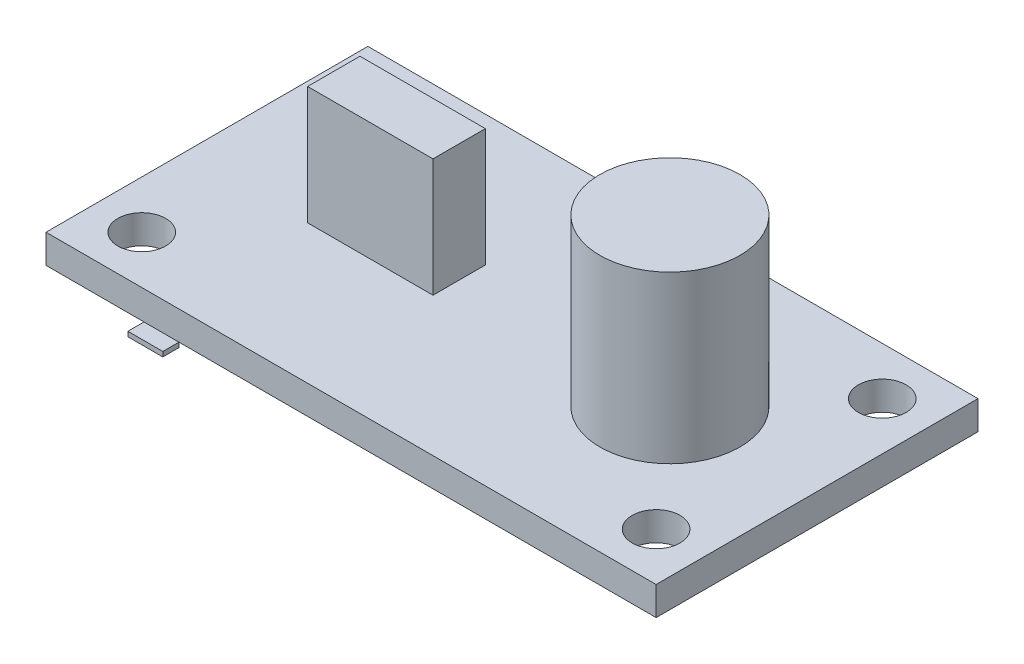
ISO-10303-21;
HEADER;
FILE_DESCRIPTION(('STEP AP214'),'2;1');
FILE_NAME('part.step','',(''),(''),'','','');
FILE_SCHEMA(('AUTOMOTIVE_DESIGN { 1 0 10303 214 1 1 1 1 }'));
ENDSEC;
DATA;
#1=APPLICATION_CONTEXT('core data for automotive mechanical design processes');
#2=APPLICATION_PROTOCOL_DEFINITION('international standard','automotive_design',2000,#1);
#3=PRODUCT_CONTEXT('',#1,'mechanical');
#4=PRODUCT('Part','Part','',(#3));
#5=PRODUCT_RELATED_PRODUCT_CATEGORY('part','',(#4));
#6=PRODUCT_DEFINITION_FORMATION('','',#4);
#7=PRODUCT_DEFINITION_CONTEXT('part definition',#1,'design');
#8=PRODUCT_DEFINITION('design','',#6,#7);
#9=PRODUCT_DEFINITION_SHAPE('','',#8);
#10=(LENGTH_UNIT() NAMED_UNIT(*) SI_UNIT(.MILLI.,.METRE.));
#11=(NAMED_UNIT(*) PLANE_ANGLE_UNIT() SI_UNIT($,.RADIAN.));
#12=(NAMED_UNIT(*) SI_UNIT($,.STERADIAN.) SOLID_ANGLE_UNIT());
#13=UNCERTAINTY_MEASURE_WITH_UNIT(LENGTH_MEASURE(1.E-05),#10,'distance_accuracy_value','');
#14=(GEOMETRIC_REPRESENTATION_CONTEXT(3) GLOBAL_UNCERTAINTY_ASSIGNED_CONTEXT((#13)) GLOBAL_UNIT_ASSIGNED_CONTEXT((#10,
#11,#12)) REPRESENTATION_CONTEXT('',''));
#15=CARTESIAN_POINT('',(0.,0.,0.));
#16=DIRECTION('',(0.,0.,1.));
#17=DIRECTION('',(1.,0.,0.));
#18=AXIS2_PLACEMENT_3D('',#15,#16,#17);
#19=CARTESIAN_POINT('',(-13.0988499559166,-2.1,4.33779347826086));
#20=DIRECTION('',(1.,0.,0.));
#21=DIRECTION('',(0.,0.,-1.));
#22=AXIS2_PLACEMENT_3D('',#19,#20,#21);
#23=PLANE('',#22);
#24=DIRECTION('',(0.,0.,-1.));
#25=VECTOR('',#24,1.);
#26=CARTESIAN_POINT('',(-13.0988499559166,-1.8,4.33779347826086));
#27=LINE('',#26,#25);
#28=CARTESIAN_POINT('',(-13.0988499559166,-1.8,5.34779347826086));
#29=VERTEX_POINT('',#28);
#30=CARTESIAN_POINT('',(-13.0988499559166,-1.8,4.33779347826086));
#31=VERTEX_POINT('',#30);
#32=EDGE_CURVE('E167',#29,#31,#27,.T.);
#33=ORIENTED_EDGE('',*,*,#32,.T.);
#34=DIRECTION('',(0.,1.,0.));
#35=VECTOR('',#34,1.);
#36=CARTESIAN_POINT('',(-13.0988499559166,-2.1,4.33779347826086));
#37=LINE('',#36,#35);
#38=CARTESIAN_POINT('',(-13.0988499559166,-2.1,4.33779347826086));
#39=VERTEX_POINT('',#38);
#40=EDGE_CURVE('E13',#39,#31,#37,.T.);
#41=ORIENTED_EDGE('',*,*,#40,.F.);
#42=DIRECTION('',(0.,0.,-1.));
#43=VECTOR('',#42,1.);
#44=CARTESIAN_POINT('',(-13.0988499559166,-2.1,4.33779347826086));
#45=LINE('',#44,#43);
#46=CARTESIAN_POINT('',(-13.0988499559166,-2.1,5.34779347826086));
#47=VERTEX_POINT('',#46);
#48=EDGE_CURVE('E155',#47,#39,#45,.T.);
#49=ORIENTED_EDGE('',*,*,#48,.F.);
#50=DIRECTION('',(0.,1.,0.));
#51=VECTOR('',#50,1.);
#52=CARTESIAN_POINT('',(-13.0988499559166,-2.1,5.34779347826086));
#53=LINE('',#52,#51);
#54=EDGE_CURVE('E163',#47,#29,#53,.T.);
#55=ORIENTED_EDGE('',*,*,#54,.T.);
#56=EDGE_LOOP('',(#33,#41,#49,#55));
#57=FACE_BOUND('',#56,.T.);
#58=ADVANCED_FACE('F104',(#57),#23,.F.);
#59=CARTESIAN_POINT('',(-13.0988499559166,-2.1,4.33779347826086));
#60=DIRECTION('',(0.,0.,1.));
#61=DIRECTION('',(1.,0.,0.));
#62=AXIS2_PLACEMENT_3D('',#59,#60,#61);
#63=PLANE('',#62);
#64=DIRECTION('',(1.,0.,0.));
#65=VECTOR('',#64,1.);
#66=CARTESIAN_POINT('',(-13.0988499559166,-1.8,4.33779347826086));
#67=LINE('',#66,#65);
#68=CARTESIAN_POINT('',(-10.9095859706834,-1.8,4.33779347826086));
#69=VERTEX_POINT('',#68);
#70=EDGE_CURVE('E159',#31,#69,#67,.T.);
#71=ORIENTED_EDGE('',*,*,#70,.T.);
#72=DIRECTION('',(0.,1.,0.));
#73=VECTOR('',#72,1.);
#74=CARTESIAN_POINT('',(-10.9095859706834,-2.1,4.33779347826086));
#75=LINE('',#74,#73);
#76=CARTESIAN_POINT('',(-10.9095859706834,-2.1,4.33779347826086));
#77=VERTEX_POINT('',#76);
#78=EDGE_CURVE('E112',#77,#69,#75,.T.);
#79=ORIENTED_EDGE('',*,*,#78,.F.);
#80=DIRECTION('',(1.,0.,0.));
#81=VECTOR('',#80,1.);
#82=CARTESIAN_POINT('',(-13.0988499559166,-2.1,4.33779347826086));
#83=LINE('',#82,#81);
#84=EDGE_CURVE('E150',#39,#77,#83,.T.);
#85=ORIENTED_EDGE('',*,*,#84,.F.);
#86=ORIENTED_EDGE('',*,*,#40,.T.);
#87=EDGE_LOOP('',(#71,#79,#85,#86));
#88=FACE_BOUND('',#87,.T.);
#89=ADVANCED_FACE('F158',(#88),#63,.F.);
#90=CARTESIAN_POINT('',(-10.9095859706834,-2.1,4.33779347826086));
#91=DIRECTION('',(-1.,0.,0.));
#92=DIRECTION('',(0.,0.,1.));
#93=AXIS2_PLACEMENT_3D('',#90,#91,#92);
#94=PLANE('',#93);
#95=DIRECTION('',(0.,0.,1.));
#96=VECTOR('',#95,1.);
#97=CARTESIAN_POINT('',(-10.9095859706834,-1.8,4.33779347826086));
#98=LINE('',#97,#96);
#99=CARTESIAN_POINT('',(-10.9095859706834,-1.8,5.34779347826086));
#100=VERTEX_POINT('',#99);
#101=EDGE_CURVE('E137',#69,#100,#98,.T.);
#102=ORIENTED_EDGE('',*,*,#101,.T.);
#103=DIRECTION('',(0.,1.,0.));
#104=VECTOR('',#103,1.);
#105=CARTESIAN_POINT('',(-10.9095859706834,-2.1,5.34779347826086));
#106=LINE('',#105,#104);
#107=CARTESIAN_POINT('',(-10.9095859706834,-2.1,5.34779347826086));
#108=VERTEX_POINT('',#107);
#109=EDGE_CURVE('E160',#108,#100,#106,.T.);
#110=ORIENTED_EDGE('',*,*,#109,.F.);
#111=DIRECTION('',(0.,0.,1.));
#112=VECTOR('',#111,1.);
#113=CARTESIAN_POINT('',(-10.9095859706834,-2.1,4.33779347826086));
#114=LINE('',#113,#112);
#115=EDGE_CURVE('E153',#77,#108,#114,.T.);
#116=ORIENTED_EDGE('',*,*,#115,.F.);
#117=ORIENTED_EDGE('',*,*,#78,.T.);
#118=EDGE_LOOP('',(#102,#110,#116,#117));
#119=FACE_BOUND('',#118,.T.);
#120=ADVANCED_FACE('F161',(#119),#94,.F.);
#121=CARTESIAN_POINT('',(-13.0988499559166,-2.1,5.34779347826086));
#122=DIRECTION('',(0.,0.,-1.));
#123=DIRECTION('',(-1.,0.,0.));
#124=AXIS2_PLACEMENT_3D('',#121,#122,#123);
#125=PLANE('',#124);
#126=DIRECTION('',(-1.,0.,0.));
#127=VECTOR('',#126,1.);
#128=CARTESIAN_POINT('',(-13.0988499559166,-1.8,5.34779347826086));
#129=LINE('',#128,#127);
#130=EDGE_CURVE('E143',#100,#29,#129,.T.);
#131=ORIENTED_EDGE('',*,*,#130,.T.);
#132=ORIENTED_EDGE('',*,*,#54,.F.);
#133=DIRECTION('',(-1.,0.,0.));
#134=VECTOR('',#133,1.);
#135=CARTESIAN_POINT('',(-13.0988499559166,-2.1,5.34779347826086));
#136=LINE('',#135,#134);
#137=EDGE_CURVE('E120',#108,#47,#136,.T.);
#138=ORIENTED_EDGE('',*,*,#137,.F.);
#139=ORIENTED_EDGE('',*,*,#109,.T.);
#140=EDGE_LOOP('',(#131,#132,#138,#139));
#141=FACE_BOUND('',#140,.T.);
#142=ADVANCED_FACE('F174',(#141),#125,.F.);
#143=CARTESIAN_POINT('',(0.,-2.1,0.));
#144=DIRECTION('',(0.,1.,0.));
#145=DIRECTION('',(0.,0.,1.));
#146=AXIS2_PLACEMENT_3D('',#143,#144,#145);
#147=PLANE('',#146);
#148=ORIENTED_EDGE('',*,*,#48,.T.);
#149=ORIENTED_EDGE('',*,*,#84,.T.);
#150=ORIENTED_EDGE('',*,*,#115,.T.);
#151=ORIENTED_EDGE('',*,*,#137,.T.);
#152=EDGE_LOOP('',(#148,#149,#150,#151));
#153=FACE_BOUND('',#152,.T.);
#154=ADVANCED_FACE('F151',(#153),#147,.F.);
#155=CARTESIAN_POINT('',(0.,-1.8,0.));
#156=DIRECTION('',(0.,1.,0.));
#157=DIRECTION('',(0.,0.,1.));
#158=AXIS2_PLACEMENT_3D('',#155,#156,#157);
#159=PLANE('',#158);
#160=ORIENTED_EDGE('',*,*,#32,.F.);
#161=ORIENTED_EDGE('',*,*,#130,.F.);
#162=ORIENTED_EDGE('',*,*,#101,.F.);
#163=ORIENTED_EDGE('',*,*,#70,.F.);
#164=EDGE_LOOP('',(#160,#161,#162,#163));
#165=FACE_BOUND('',#164,.T.);
#166=ADVANCED_FACE('F177',(#165),#159,.T.);
#167=CLOSED_SHELL('',(#58,#89,#120,#142,#154,#166));
#168=MANIFOLD_SOLID_BREP('B2',#167);
#169=CARTESIAN_POINT('',(-19.2396630434783,-1.8,-15.8322065217391));
#170=DIRECTION('',(0.,0.,1.));
#171=DIRECTION('',(1.,0.,0.));
#172=AXIS2_PLACEMENT_3D('',#169,#170,#171);
#173=PLANE('',#172);
#174=DIRECTION('',(1.,0.,0.));
#175=VECTOR('',#174,1.);
#176=CARTESIAN_POINT('',(-19.2396630434783,0.,-15.8322065217391));
#177=LINE('',#176,#175);
#178=CARTESIAN_POINT('',(-19.2396630434783,0.,-15.8322065217391));
#179=VERTEX_POINT('',#178);
#180=CARTESIAN_POINT('',(18.9903369565217,0.,-15.8322065217391));
#181=VERTEX_POINT('',#180);
#182=EDGE_CURVE('E357',#179,#181,#177,.T.);
#183=ORIENTED_EDGE('',*,*,#182,.T.);
#184=DIRECTION('',(0.,1.,0.));
#185=VECTOR('',#184,1.);
#186=CARTESIAN_POINT('',(18.9903369565217,-1.8,-15.8322065217391));
#187=LINE('',#186,#185);
#188=CARTESIAN_POINT('',(18.9903369565217,-1.8,-15.8322065217391));
#189=VERTEX_POINT('',#188);
#190=EDGE_CURVE('E382',#189,#181,#187,.T.);
#191=ORIENTED_EDGE('',*,*,#190,.F.);
#192=DIRECTION('',(1.,0.,0.));
#193=VECTOR('',#192,1.);
#194=CARTESIAN_POINT('',(-19.2396630434783,-1.8,-15.8322065217391));
#195=LINE('',#194,#193);
#196=CARTESIAN_POINT('',(-19.2396630434783,-1.8,-15.8322065217391));
#197=VERTEX_POINT('',#196);
#198=EDGE_CURVE('E360',#197,#189,#195,.T.);
#199=ORIENTED_EDGE('',*,*,#198,.F.);
#200=DIRECTION('',(0.,1.,0.));
#201=VECTOR('',#200,1.);
#202=CARTESIAN_POINT('',(-19.2396630434783,-1.8,-15.8322065217391));
#203=LINE('',#202,#201);
#204=EDGE_CURVE('E250',#197,#179,#203,.T.);
#205=ORIENTED_EDGE('',*,*,#204,.T.);
#206=EDGE_LOOP('',(#183,#191,#199,#205));
#207=FACE_BOUND('',#206,.T.);
#208=ADVANCED_FACE('F227',(#207),#173,.F.);
#209=CARTESIAN_POINT('',(18.9903369565217,-1.8,-15.8322065217391));
#210=DIRECTION('',(-1.,0.,0.));
#211=DIRECTION('',(0.,0.,1.));
#212=AXIS2_PLACEMENT_3D('',#209,#210,#211);
#213=PLANE('',#212);
#214=DIRECTION('',(0.,0.,1.));
#215=VECTOR('',#214,1.);
#216=CARTESIAN_POINT('',(18.9903369565217,0.,-15.8322065217391));
#217=LINE('',#216,#215);
#218=CARTESIAN_POINT('',(18.9903369565217,0.,4.33779347826086));
#219=VERTEX_POINT('',#218);
#220=EDGE_CURVE('E369',#181,#219,#217,.T.);
#221=ORIENTED_EDGE('',*,*,#220,.T.);
#222=DIRECTION('',(0.,1.,0.));
#223=VECTOR('',#222,1.);
#224=CARTESIAN_POINT('',(18.9903369565217,-1.8,4.33779347826086));
#225=LINE('',#224,#223);
#226=CARTESIAN_POINT('',(18.9903369565217,-1.8,4.33779347826086));
#227=VERTEX_POINT('',#226);
#228=EDGE_CURVE('E380',#227,#219,#225,.T.);
#229=ORIENTED_EDGE('',*,*,#228,.F.);
#230=DIRECTION('',(0.,0.,1.));
#231=VECTOR('',#230,1.);
#232=CARTESIAN_POINT('',(18.9903369565217,-1.8,-15.8322065217391));
#233=LINE('',#232,#231);
#234=EDGE_CURVE('E277',#189,#227,#233,.T.);
#235=ORIENTED_EDGE('',*,*,#234,.F.);
#236=ORIENTED_EDGE('',*,*,#190,.T.);
#237=EDGE_LOOP('',(#221,#229,#235,#236));
#238=FACE_BOUND('',#237,.T.);
#239=ADVANCED_FACE('F406',(#238),#213,.F.);
#240=CARTESIAN_POINT('',(-19.2396630434783,-1.8,4.33779347826086));
#241=DIRECTION('',(0.,0.,1.));
#242=DIRECTION('',(1.,0.,0.));
#243=AXIS2_PLACEMENT_3D('',#240,#241,#242);
#244=PLANE('',#243);
#245=DIRECTION('',(1.,0.,0.));
#246=VECTOR('',#245,1.);
#247=CARTESIAN_POINT('',(-19.2396630434783,0.,4.33779347826086));
#248=LINE('',#247,#246);
#249=CARTESIAN_POINT('',(-19.2396630434783,0.,4.33779347826086));
#250=VERTEX_POINT('',#249);
#251=EDGE_CURVE('E372',#250,#219,#248,.T.);
#252=ORIENTED_EDGE('',*,*,#251,.F.);
#253=DIRECTION('',(0.,1.,0.));
#254=VECTOR('',#253,1.);
#255=CARTESIAN_POINT('',(-19.2396630434783,-1.8,4.33779347826086));
#256=LINE('',#255,#254);
#257=CARTESIAN_POINT('',(-19.2396630434783,-1.8,4.33779347826086));
#258=VERTEX_POINT('',#257);
#259=EDGE_CURVE('E378',#258,#250,#256,.T.);
#260=ORIENTED_EDGE('',*,*,#259,.F.);
#261=DIRECTION('',(1.,0.,0.));
#262=VECTOR('',#261,1.);
#263=CARTESIAN_POINT('',(-19.2396630434783,-1.8,4.33779347826086));
#264=LINE('',#263,#262);
#265=EDGE_CURVE('E364',#258,#227,#264,.T.);
#266=ORIENTED_EDGE('',*,*,#265,.T.);
#267=ORIENTED_EDGE('',*,*,#228,.T.);
#268=EDGE_LOOP('',(#252,#260,#266,#267));
#269=FACE_BOUND('',#268,.T.);
#270=ADVANCED_FACE('F410',(#269),#244,.T.);
#271=CARTESIAN_POINT('',(-19.2396630434783,-1.8,-15.8322065217391));
#272=DIRECTION('',(-1.,0.,0.));
#273=DIRECTION('',(0.,0.,1.));
#274=AXIS2_PLACEMENT_3D('',#271,#272,#273);
#275=PLANE('',#274);
#276=DIRECTION('',(0.,0.,1.));
#277=VECTOR('',#276,1.);
#278=CARTESIAN_POINT('',(-19.2396630434783,0.,-15.8322065217391));
#279=LINE('',#278,#277);
#280=EDGE_CURVE('E362',#179,#250,#279,.T.);
#281=ORIENTED_EDGE('',*,*,#280,.F.);
#282=ORIENTED_EDGE('',*,*,#204,.F.);
#283=DIRECTION('',(0.,0.,1.));
#284=VECTOR('',#283,1.);
#285=CARTESIAN_POINT('',(-19.2396630434783,-1.8,-15.8322065217391));
#286=LINE('',#285,#284);
#287=EDGE_CURVE('E366',#197,#258,#286,.T.);
#288=ORIENTED_EDGE('',*,*,#287,.T.);
#289=ORIENTED_EDGE('',*,*,#259,.T.);
#290=EDGE_LOOP('',(#281,#282,#288,#289));
#291=FACE_BOUND('',#290,.T.);
#292=ADVANCED_FACE('F413',(#291),#275,.T.);
#293=CARTESIAN_POINT('',(0.,-1.8,0.));
#294=DIRECTION('',(0.,-1.,0.));
#295=DIRECTION('',(0.,0.,-1.));
#296=AXIS2_PLACEMENT_3D('',#293,#294,#295);
#297=PLANE('',#296);
#298=CARTESIAN_POINT('',(15.9903369565217,-1.8,-12.8322065217391));
#299=DIRECTION('',(0.,1.,0.));
#300=DIRECTION('',(0.,0.,1.));
#301=AXIS2_PLACEMENT_3D('',#298,#299,#300);
#302=CIRCLE('',#301,1.5);
#303=CARTESIAN_POINT('',(15.9903369565217,-1.8,-11.3322065217391));
#304=VERTEX_POINT('',#303);
#305=EDGE_CURVE('E335',#304,#304,#302,.T.);
#306=ORIENTED_EDGE('',*,*,#305,.T.);
#307=EDGE_LOOP('',(#306));
#308=FACE_BOUND('',#307,.T.);
#309=CARTESIAN_POINT('',(15.9903369565217,-1.8,1.33779347826086));
#310=DIRECTION('',(0.,1.,0.));
#311=DIRECTION('',(0.,0.,1.));
#312=AXIS2_PLACEMENT_3D('',#309,#310,#311);
#313=CIRCLE('',#312,1.5);
#314=CARTESIAN_POINT('',(15.9903369565217,-1.8,2.83779347826086));
#315=VERTEX_POINT('',#314);
#316=EDGE_CURVE('E342',#315,#315,#313,.T.);
#317=ORIENTED_EDGE('',*,*,#316,.T.);
#318=EDGE_LOOP('',(#317));
#319=FACE_BOUND('',#318,.T.);
#320=CARTESIAN_POINT('',(-16.2396630434783,-1.8,-12.8322065217391));
#321=DIRECTION('',(0.,1.,0.));
#322=DIRECTION('',(0.,0.,1.));
#323=AXIS2_PLACEMENT_3D('',#320,#321,#322);
#324=CIRCLE('',#323,1.5);
#325=CARTESIAN_POINT('',(-16.2396630434783,-1.8,-11.3322065217391));
#326=VERTEX_POINT('',#325);
#327=EDGE_CURVE('E348',#326,#326,#324,.T.);
#328=ORIENTED_EDGE('',*,*,#327,.T.);
#329=EDGE_LOOP('',(#328));
#330=FACE_BOUND('',#329,.T.);
#331=CARTESIAN_POINT('',(-16.2396630434783,-1.8,1.33779347826087));
#332=DIRECTION('',(0.,1.,0.));
#333=DIRECTION('',(0.,0.,1.));
#334=AXIS2_PLACEMENT_3D('',#331,#332,#333);
#335=CIRCLE('',#334,1.5);
#336=CARTESIAN_POINT('',(-16.2396630434783,-1.8,2.83779347826087));
#337=VERTEX_POINT('',#336);
#338=EDGE_CURVE('E354',#337,#337,#335,.T.);
#339=ORIENTED_EDGE('',*,*,#338,.T.);
#340=EDGE_LOOP('',(#339));
#341=FACE_BOUND('',#340,.T.);
#342=ORIENTED_EDGE('',*,*,#198,.T.);
#343=ORIENTED_EDGE('',*,*,#234,.T.);
#344=ORIENTED_EDGE('',*,*,#265,.F.);
#345=ORIENTED_EDGE('',*,*,#287,.F.);
#346=EDGE_LOOP('',(#342,#343,#344,#345));
#347=FACE_BOUND('',#346,.T.);
#348=ADVANCED_FACE('F419',(#308,#319,#330,#341,#347),#297,.T.);
#349=CARTESIAN_POINT('',(0.,0.,0.));
#350=DIRECTION('',(0.,-1.,0.));
#351=DIRECTION('',(0.,0.,-1.));
#352=AXIS2_PLACEMENT_3D('',#349,#350,#351);
#353=PLANE('',#352);
#354=DIRECTION('',(-1.,0.,0.));
#355=VECTOR('',#354,1.);
#356=CARTESIAN_POINT('',(0.,0.,-4.36815818553251));
#357=LINE('',#356,#355);
#358=CARTESIAN_POINT('',(-3.69639142970518,0.,-4.36815818553251));
#359=VERTEX_POINT('',#358);
#360=CARTESIAN_POINT('',(-11.5520357353644,0.,-4.36815818553251));
#361=VERTEX_POINT('',#360);
#362=EDGE_CURVE('E234',#359,#361,#357,.T.);
#363=ORIENTED_EDGE('',*,*,#362,.T.);
#364=DIRECTION('',(0.,0.,-1.));
#365=VECTOR('',#364,1.);
#366=CARTESIAN_POINT('',(-11.5520357353644,0.,0.));
#367=LINE('',#366,#365);
#368=CARTESIAN_POINT('',(-11.5520357353644,0.,-7.64853712635723));
#369=VERTEX_POINT('',#368);
#370=EDGE_CURVE('E102',#361,#369,#367,.T.);
#371=ORIENTED_EDGE('',*,*,#370,.T.);
#372=DIRECTION('',(1.,0.,0.));
#373=VECTOR('',#372,1.);
#374=CARTESIAN_POINT('',(0.,0.,-7.64853712635723));
#375=LINE('',#374,#373);
#376=CARTESIAN_POINT('',(-3.69639142970518,0.,-7.64853712635723));
#377=VERTEX_POINT('',#376);
#378=EDGE_CURVE('E304',#369,#377,#375,.T.);
#379=ORIENTED_EDGE('',*,*,#378,.T.);
#380=DIRECTION('',(0.,0.,1.));
#381=VECTOR('',#380,1.);
#382=CARTESIAN_POINT('',(-3.69639142970518,0.,0.));
#383=LINE('',#382,#381);
#384=EDGE_CURVE('E387',#377,#359,#383,.T.);
#385=ORIENTED_EDGE('',*,*,#384,.T.);
#386=EDGE_LOOP('',(#363,#371,#379,#385));
#387=FACE_BOUND('',#386,.T.);
#388=CARTESIAN_POINT('',(9.77042737999628,0.,-5.74720652173914));
#389=DIRECTION('',(0.,-1.,0.));
#390=DIRECTION('',(0.,0.,-1.));
#391=AXIS2_PLACEMENT_3D('',#388,#389,#390);
#392=CIRCLE('',#391,4.39011271109069);
#393=CARTESIAN_POINT('',(9.77042737999628,0.,-10.1373192328298));
#394=VERTEX_POINT('',#393);
#395=EDGE_CURVE('E334',#394,#394,#392,.T.);
#396=ORIENTED_EDGE('',*,*,#395,.T.);
#397=EDGE_LOOP('',(#396));
#398=FACE_BOUND('',#397,.T.);
#399=CARTESIAN_POINT('',(15.9903369565217,0.,-12.8322065217391));
#400=DIRECTION('',(0.,1.,0.));
#401=DIRECTION('',(0.,0.,1.));
#402=AXIS2_PLACEMENT_3D('',#399,#400,#401);
#403=CIRCLE('',#402,1.5);
#404=CARTESIAN_POINT('',(15.9903369565217,0.,-11.3322065217391));
#405=VERTEX_POINT('',#404);
#406=EDGE_CURVE('E339',#405,#405,#403,.T.);
#407=ORIENTED_EDGE('',*,*,#406,.F.);
#408=EDGE_LOOP('',(#407));
#409=FACE_BOUND('',#408,.T.);
#410=CARTESIAN_POINT('',(15.9903369565217,0.,1.33779347826086));
#411=DIRECTION('',(0.,1.,0.));
#412=DIRECTION('',(0.,0.,1.));
#413=AXIS2_PLACEMENT_3D('',#410,#411,#412);
#414=CIRCLE('',#413,1.5);
#415=CARTESIAN_POINT('',(15.9903369565217,0.,2.83779347826086));
#416=VERTEX_POINT('',#415);
#417=EDGE_CURVE('E338',#416,#416,#414,.T.);
#418=ORIENTED_EDGE('',*,*,#417,.F.);
#419=EDGE_LOOP('',(#418));
#420=FACE_BOUND('',#419,.T.);
#421=CARTESIAN_POINT('',(-16.2396630434783,0.,-12.8322065217391));
#422=DIRECTION('',(0.,1.,0.));
#423=DIRECTION('',(0.,0.,1.));
#424=AXIS2_PLACEMENT_3D('',#421,#422,#423);
#425=CIRCLE('',#424,1.5);
#426=CARTESIAN_POINT('',(-16.2396630434783,0.,-11.3322065217391));
#427=VERTEX_POINT('',#426);
#428=EDGE_CURVE('E345',#427,#427,#425,.T.);
#429=ORIENTED_EDGE('',*,*,#428,.F.);
#430=EDGE_LOOP('',(#429));
#431=FACE_BOUND('',#430,.T.);
#432=CARTESIAN_POINT('',(-16.2396630434783,0.,1.33779347826087));
#433=DIRECTION('',(0.,1.,0.));
#434=DIRECTION('',(0.,0.,1.));
#435=AXIS2_PLACEMENT_3D('',#432,#433,#434);
#436=CIRCLE('',#435,1.5);
#437=CARTESIAN_POINT('',(-16.2396630434783,0.,2.83779347826087));
#438=VERTEX_POINT('',#437);
#439=EDGE_CURVE('E351',#438,#438,#436,.T.);
#440=ORIENTED_EDGE('',*,*,#439,.F.);
#441=EDGE_LOOP('',(#440));
#442=FACE_BOUND('',#441,.T.);
#443=ORIENTED_EDGE('',*,*,#182,.F.);
#444=ORIENTED_EDGE('',*,*,#280,.T.);
#445=ORIENTED_EDGE('',*,*,#251,.T.);
#446=ORIENTED_EDGE('',*,*,#220,.F.);
#447=EDGE_LOOP('',(#443,#444,#445,#446));
#448=FACE_BOUND('',#447,.T.);
#449=ADVANCED_FACE('F391',(#387,#398,#409,#420,#431,#442,#448),#353,.F.);
#450=CARTESIAN_POINT('',(-16.2396630434783,-1.8,1.33779347826087));
#451=DIRECTION('',(0.,1.,0.));
#452=DIRECTION('',(0.,0.,1.));
#453=AXIS2_PLACEMENT_3D('',#450,#451,#452);
#454=CYLINDRICAL_SURFACE('',#453,1.5);
#455=ORIENTED_EDGE('',*,*,#338,.F.);
#456=EDGE_LOOP('',(#455));
#457=FACE_BOUND('',#456,.T.);
#458=ORIENTED_EDGE('',*,*,#439,.T.);
#459=EDGE_LOOP('',(#458));
#460=FACE_BOUND('',#459,.T.);
#461=ADVANCED_FACE('F427',(#457,#460),#454,.F.);
#462=CARTESIAN_POINT('',(-16.2396630434783,-1.8,-12.8322065217391));
#463=DIRECTION('',(0.,1.,0.));
#464=DIRECTION('',(0.,0.,1.));
#465=AXIS2_PLACEMENT_3D('',#462,#463,#464);
#466=CYLINDRICAL_SURFACE('',#465,1.5);
#467=ORIENTED_EDGE('',*,*,#327,.F.);
#468=EDGE_LOOP('',(#467));
#469=FACE_BOUND('',#468,.T.);
#470=ORIENTED_EDGE('',*,*,#428,.T.);
#471=EDGE_LOOP('',(#470));
#472=FACE_BOUND('',#471,.T.);
#473=ADVANCED_FACE('F457',(#469,#472),#466,.F.);
#474=CARTESIAN_POINT('',(15.9903369565217,-1.8,1.33779347826086));
#475=DIRECTION('',(0.,1.,0.));
#476=DIRECTION('',(0.,0.,1.));
#477=AXIS2_PLACEMENT_3D('',#474,#475,#476);
#478=CYLINDRICAL_SURFACE('',#477,1.5);
#479=ORIENTED_EDGE('',*,*,#316,.F.);
#480=EDGE_LOOP('',(#479));
#481=FACE_BOUND('',#480,.T.);
#482=ORIENTED_EDGE('',*,*,#417,.T.);
#483=EDGE_LOOP('',(#482));
#484=FACE_BOUND('',#483,.T.);
#485=ADVANCED_FACE('F467',(#481,#484),#478,.F.);
#486=CARTESIAN_POINT('',(15.9903369565217,-1.8,-12.8322065217391));
#487=DIRECTION('',(0.,1.,0.));
#488=DIRECTION('',(0.,0.,1.));
#489=AXIS2_PLACEMENT_3D('',#486,#487,#488);
#490=CYLINDRICAL_SURFACE('',#489,1.5);
#491=ORIENTED_EDGE('',*,*,#305,.F.);
#492=EDGE_LOOP('',(#491));
#493=FACE_BOUND('',#492,.T.);
#494=ORIENTED_EDGE('',*,*,#406,.T.);
#495=EDGE_LOOP('',(#494));
#496=FACE_BOUND('',#495,.T.);
#497=ADVANCED_FACE('F475',(#493,#496),#490,.F.);
#498=CARTESIAN_POINT('',(9.77042737999628,10.4,-5.74720652173914));
#499=DIRECTION('',(0.,-1.,0.));
#500=DIRECTION('',(0.,0.,-1.));
#501=AXIS2_PLACEMENT_3D('',#498,#499,#500);
#502=CYLINDRICAL_SURFACE('',#501,4.39011271109069);
#503=CARTESIAN_POINT('',(9.77042737999628,10.4,-5.74720652173914));
#504=DIRECTION('',(0.,-1.,0.));
#505=DIRECTION('',(0.,0.,-1.));
#506=AXIS2_PLACEMENT_3D('',#503,#504,#505);
#507=CIRCLE('',#506,4.39011271109069);
#508=CARTESIAN_POINT('',(9.77042737999628,10.4,-10.1373192328298));
#509=VERTEX_POINT('',#508);
#510=EDGE_CURVE('E327',#509,#509,#507,.T.);
#511=ORIENTED_EDGE('',*,*,#510,.T.);
#512=EDGE_LOOP('',(#511));
#513=FACE_BOUND('',#512,.T.);
#514=ORIENTED_EDGE('',*,*,#395,.F.);
#515=EDGE_LOOP('',(#514));
#516=FACE_BOUND('',#515,.T.);
#517=ADVANCED_FACE('F484',(#513,#516),#502,.T.);
#518=CARTESIAN_POINT('',(9.77042737999628,10.4,-5.74720652173914));
#519=DIRECTION('',(0.,-1.,0.));
#520=DIRECTION('',(0.,0.,-1.));
#521=AXIS2_PLACEMENT_3D('',#518,#519,#520);
#522=PLANE('',#521);
#523=ORIENTED_EDGE('',*,*,#510,.F.);
#524=EDGE_LOOP('',(#523));
#525=FACE_BOUND('',#524,.T.);
#526=ADVANCED_FACE('F494',(#525),#522,.F.);
#527=CARTESIAN_POINT('',(-11.5520357353644,7.4,-4.36815818553251));
#528=DIRECTION('',(-1.,0.,0.));
#529=DIRECTION('',(0.,0.,1.));
#530=AXIS2_PLACEMENT_3D('',#527,#528,#529);
#531=PLANE('',#530);
#532=ORIENTED_EDGE('',*,*,#370,.F.);
#533=DIRECTION('',(0.,-1.,0.));
#534=VECTOR('',#533,1.);
#535=CARTESIAN_POINT('',(-11.5520357353644,7.4,-4.36815818553251));
#536=LINE('',#535,#534);
#537=CARTESIAN_POINT('',(-11.5520357353644,7.4,-4.36815818553251));
#538=VERTEX_POINT('',#537);
#539=EDGE_CURVE('E321',#538,#361,#536,.T.);
#540=ORIENTED_EDGE('',*,*,#539,.F.);
#541=DIRECTION('',(0.,0.,-1.));
#542=VECTOR('',#541,1.);
#543=CARTESIAN_POINT('',(-11.5520357353644,7.4,-4.36815818553251));
#544=LINE('',#543,#542);
#545=CARTESIAN_POINT('',(-11.5520357353644,7.4,-7.64853712635723));
#546=VERTEX_POINT('',#545);
#547=EDGE_CURVE('E314',#538,#546,#544,.T.);
#548=ORIENTED_EDGE('',*,*,#547,.T.);
#549=DIRECTION('',(0.,-1.,0.));
#550=VECTOR('',#549,1.);
#551=CARTESIAN_POINT('',(-11.5520357353644,7.4,-7.64853712635723));
#552=LINE('',#551,#550);
#553=EDGE_CURVE('E299',#546,#369,#552,.T.);
#554=ORIENTED_EDGE('',*,*,#553,.T.);
#555=EDGE_LOOP('',(#532,#540,#548,#554));
#556=FACE_BOUND('',#555,.T.);
#557=ADVANCED_FACE('F319',(#556),#531,.T.);
#558=CARTESIAN_POINT('',(-11.5520357353644,7.4,-4.36815818553251));
#559=DIRECTION('',(0.,0.,1.));
#560=DIRECTION('',(1.,0.,0.));
#561=AXIS2_PLACEMENT_3D('',#558,#559,#560);
#562=PLANE('',#561);
#563=ORIENTED_EDGE('',*,*,#362,.F.);
#564=DIRECTION('',(0.,-1.,0.));
#565=VECTOR('',#564,1.);
#566=CARTESIAN_POINT('',(-3.69639142970518,7.4,-4.36815818553251));
#567=LINE('',#566,#565);
#568=CARTESIAN_POINT('',(-3.69639142970518,7.4,-4.36815818553251));
#569=VERTEX_POINT('',#568);
#570=EDGE_CURVE('E328',#569,#359,#567,.T.);
#571=ORIENTED_EDGE('',*,*,#570,.F.);
#572=DIRECTION('',(-1.,0.,0.));
#573=VECTOR('',#572,1.);
#574=CARTESIAN_POINT('',(-11.5520357353644,7.4,-4.36815818553251));
#575=LINE('',#574,#573);
#576=EDGE_CURVE('E307',#569,#538,#575,.T.);
#577=ORIENTED_EDGE('',*,*,#576,.T.);
#578=ORIENTED_EDGE('',*,*,#539,.T.);
#579=EDGE_LOOP('',(#563,#571,#577,#578));
#580=FACE_BOUND('',#579,.T.);
#581=ADVANCED_FACE('F394',(#580),#562,.T.);
#582=CARTESIAN_POINT('',(-3.69639142970518,7.4,-4.36815818553251));
#583=DIRECTION('',(1.,0.,0.));
#584=DIRECTION('',(0.,0.,-1.));
#585=AXIS2_PLACEMENT_3D('',#582,#583,#584);
#586=PLANE('',#585);
#587=ORIENTED_EDGE('',*,*,#384,.F.);
#588=DIRECTION('',(0.,-1.,0.));
#589=VECTOR('',#588,1.);
#590=CARTESIAN_POINT('',(-3.69639142970518,7.4,-7.64853712635723));
#591=LINE('',#590,#589);
#592=CARTESIAN_POINT('',(-3.69639142970518,7.4,-7.64853712635723));
#593=VERTEX_POINT('',#592);
#594=EDGE_CURVE('E241',#593,#377,#591,.T.);
#595=ORIENTED_EDGE('',*,*,#594,.F.);
#596=DIRECTION('',(0.,0.,1.));
#597=VECTOR('',#596,1.);
#598=CARTESIAN_POINT('',(-3.69639142970518,7.4,-4.36815818553251));
#599=LINE('',#598,#597);
#600=EDGE_CURVE('E317',#593,#569,#599,.T.);
#601=ORIENTED_EDGE('',*,*,#600,.T.);
#602=ORIENTED_EDGE('',*,*,#570,.T.);
#603=EDGE_LOOP('',(#587,#595,#601,#602));
#604=FACE_BOUND('',#603,.T.);
#605=ADVANCED_FACE('F396',(#604),#586,.T.);
#606=CARTESIAN_POINT('',(-11.5520357353644,7.4,-7.64853712635723));
#607=DIRECTION('',(0.,0.,-1.));
#608=DIRECTION('',(-1.,0.,0.));
#609=AXIS2_PLACEMENT_3D('',#606,#607,#608);
#610=PLANE('',#609);
#611=ORIENTED_EDGE('',*,*,#378,.F.);
#612=ORIENTED_EDGE('',*,*,#553,.F.);
#613=DIRECTION('',(1.,0.,0.));
#614=VECTOR('',#613,1.);
#615=CARTESIAN_POINT('',(-11.5520357353644,7.4,-7.64853712635723));
#616=LINE('',#615,#614);
#617=EDGE_CURVE('E302',#546,#593,#616,.T.);
#618=ORIENTED_EDGE('',*,*,#617,.T.);
#619=ORIENTED_EDGE('',*,*,#594,.T.);
#620=EDGE_LOOP('',(#611,#612,#618,#619));
#621=FACE_BOUND('',#620,.T.);
#622=ADVANCED_FACE('F301',(#621),#610,.T.);
#623=CARTESIAN_POINT('',(0.,7.4,0.));
#624=DIRECTION('',(0.,-1.,0.));
#625=DIRECTION('',(0.,0.,-1.));
#626=AXIS2_PLACEMENT_3D('',#623,#624,#625);
#627=PLANE('',#626);
#628=ORIENTED_EDGE('',*,*,#547,.F.);
#629=ORIENTED_EDGE('',*,*,#576,.F.);
#630=ORIENTED_EDGE('',*,*,#600,.F.);
#631=ORIENTED_EDGE('',*,*,#617,.F.);
#632=EDGE_LOOP('',(#628,#629,#630,#631));
#633=FACE_BOUND('',#632,.T.);
#634=ADVANCED_FACE('F312',(#633),#627,.F.);
#635=CLOSED_SHELL('',(#208,#239,#270,#292,#348,#449,#461,#473,#485,#497,#517,#526,#557,#581,
#605,#622,#634));
#636=MANIFOLD_SOLID_BREP('B7',#635);
#637=ADVANCED_BREP_SHAPE_REPRESENTATION('',(#18,#168,#636),#14);
#638=SHAPE_DEFINITION_REPRESENTATION(#9,#637);
ENDSEC;
END-ISO-10303-21;
